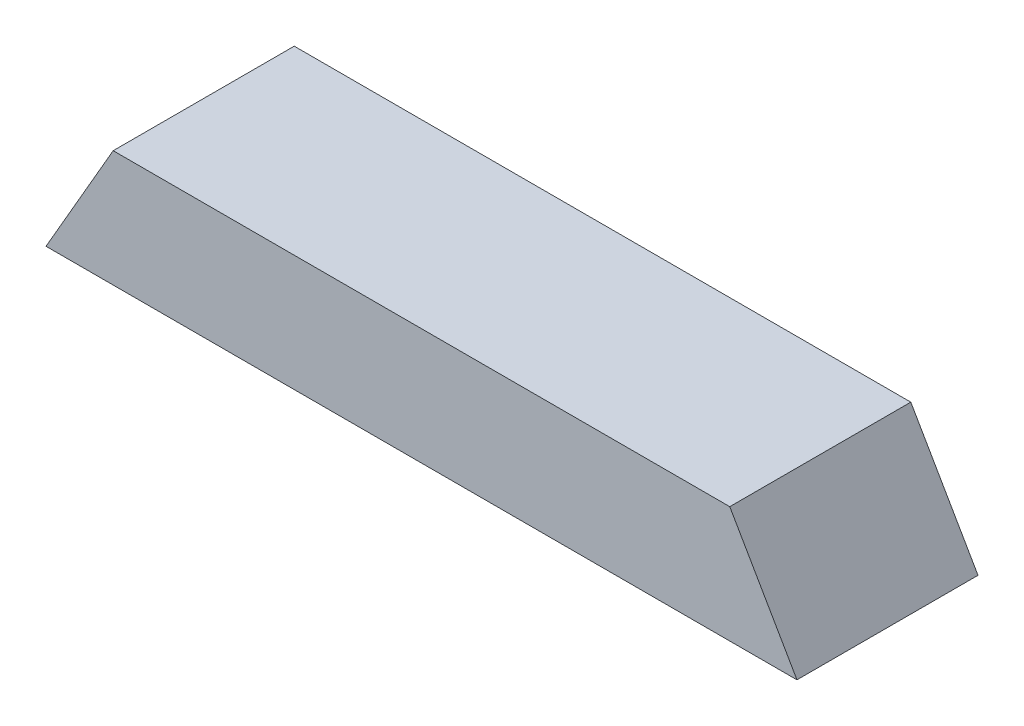
ISO-10303-21;
HEADER;
FILE_DESCRIPTION(('STEP AP214'),'2;1');
FILE_NAME('part.step','',(''),(''),'','','');
FILE_SCHEMA(('AUTOMOTIVE_DESIGN { 1 0 10303 214 1 1 1 1 }'));
ENDSEC;
DATA;
#1=APPLICATION_CONTEXT('core data for automotive mechanical design processes');
#2=APPLICATION_PROTOCOL_DEFINITION('international standard','automotive_design',2000,#1);
#3=PRODUCT_CONTEXT('',#1,'mechanical');
#4=PRODUCT('Part','Part','',(#3));
#5=PRODUCT_RELATED_PRODUCT_CATEGORY('part','',(#4));
#6=PRODUCT_DEFINITION_FORMATION('','',#4);
#7=PRODUCT_DEFINITION_CONTEXT('part definition',#1,'design');
#8=PRODUCT_DEFINITION('design','',#6,#7);
#9=PRODUCT_DEFINITION_SHAPE('','',#8);
#10=(LENGTH_UNIT() NAMED_UNIT(*) SI_UNIT(.MILLI.,.METRE.));
#11=(NAMED_UNIT(*) PLANE_ANGLE_UNIT() SI_UNIT($,.RADIAN.));
#12=(NAMED_UNIT(*) SI_UNIT($,.STERADIAN.) SOLID_ANGLE_UNIT());
#13=UNCERTAINTY_MEASURE_WITH_UNIT(LENGTH_MEASURE(1.E-05),#10,'distance_accuracy_value','');
#14=(GEOMETRIC_REPRESENTATION_CONTEXT(3) GLOBAL_UNCERTAINTY_ASSIGNED_CONTEXT((#13)) GLOBAL_UNIT_ASSIGNED_CONTEXT((#10,
#11,#12)) REPRESENTATION_CONTEXT('',''));
#15=CARTESIAN_POINT('',(0.,0.,0.));
#16=DIRECTION('',(0.,0.,1.));
#17=DIRECTION('',(1.,0.,0.));
#18=AXIS2_PLACEMENT_3D('',#15,#16,#17);
#19=CARTESIAN_POINT('',(0.,3.6,0.));
#20=DIRECTION('',(0.,0.,-1.));
#21=DIRECTION('',(-1.,0.,0.));
#22=AXIS2_PLACEMENT_3D('',#19,#20,#21);
#23=PLANE('',#22);
#24=DIRECTION('',(1.,0.,0.));
#25=VECTOR('',#24,1.);
#26=CARTESIAN_POINT('',(0.,0.,0.));
#27=LINE('',#26,#25);
#28=CARTESIAN_POINT('',(1.38564064605514,0.,0.));
#29=VERTEX_POINT('',#28);
#30=CARTESIAN_POINT('',(24.6143593539449,0.,0.));
#31=VERTEX_POINT('',#30);
#32=EDGE_CURVE('E114',#29,#31,#27,.T.);
#33=ORIENTED_EDGE('',*,*,#32,.T.);
#34=DIRECTION('',(0.500000000000006,-0.866025403784436,0.));
#35=VECTOR('',#34,1.);
#36=CARTESIAN_POINT('',(22.5358983848622,3.6,0.));
#37=LINE('',#36,#35);
#38=CARTESIAN_POINT('',(22.5358983848622,3.6,0.));
#39=VERTEX_POINT('',#38);
#40=EDGE_CURVE('E11',#31,#39,#37,.F.);
#41=ORIENTED_EDGE('',*,*,#40,.T.);
#42=DIRECTION('',(1.,0.,0.));
#43=VECTOR('',#42,1.);
#44=CARTESIAN_POINT('',(0.,3.6,0.));
#45=LINE('',#44,#43);
#46=CARTESIAN_POINT('',(3.46410161513782,3.6,0.));
#47=VERTEX_POINT('',#46);
#48=EDGE_CURVE('E99',#47,#39,#45,.T.);
#49=ORIENTED_EDGE('',*,*,#48,.F.);
#50=DIRECTION('',(0.500000000000006,0.866025403784436,0.));
#51=VECTOR('',#50,1.);
#52=CARTESIAN_POINT('',(3.46410161513782,3.6,0.));
#53=LINE('',#52,#51);
#54=EDGE_CURVE('E57',#47,#29,#53,.F.);
#55=ORIENTED_EDGE('',*,*,#54,.T.);
#56=EDGE_LOOP('',(#33,#41,#49,#55));
#57=FACE_BOUND('',#56,.T.);
#58=ADVANCED_FACE('F47',(#57),#23,.F.);
#59=CARTESIAN_POINT('',(0.,3.6,-5.6));
#60=DIRECTION('',(0.,0.,1.));
#61=DIRECTION('',(1.,0.,0.));
#62=AXIS2_PLACEMENT_3D('',#59,#60,#61);
#63=PLANE('',#62);
#64=DIRECTION('',(-1.,0.,0.));
#65=VECTOR('',#64,1.);
#66=CARTESIAN_POINT('',(0.,3.6,-5.6));
#67=LINE('',#66,#65);
#68=CARTESIAN_POINT('',(22.5358983848622,3.6,-5.6));
#69=VERTEX_POINT('',#68);
#70=CARTESIAN_POINT('',(3.46410161513782,3.6,-5.6));
#71=VERTEX_POINT('',#70);
#72=EDGE_CURVE('E102',#69,#71,#67,.T.);
#73=ORIENTED_EDGE('',*,*,#72,.F.);
#74=DIRECTION('',(-0.500000000000006,0.866025403784436,0.));
#75=VECTOR('',#74,1.);
#76=CARTESIAN_POINT('',(22.5358983848622,3.6,-5.6));
#77=LINE('',#76,#75);
#78=CARTESIAN_POINT('',(24.6143593539449,0.,-5.6));
#79=VERTEX_POINT('',#78);
#80=EDGE_CURVE('E124',#69,#79,#77,.F.);
#81=ORIENTED_EDGE('',*,*,#80,.T.);
#82=DIRECTION('',(-1.,0.,0.));
#83=VECTOR('',#82,1.);
#84=CARTESIAN_POINT('',(0.,0.,-5.6));
#85=LINE('',#84,#83);
#86=CARTESIAN_POINT('',(1.38564064605514,0.,-5.6));
#87=VERTEX_POINT('',#86);
#88=EDGE_CURVE('E108',#79,#87,#85,.T.);
#89=ORIENTED_EDGE('',*,*,#88,.T.);
#90=DIRECTION('',(-0.500000000000006,-0.866025403784436,0.));
#91=VECTOR('',#90,1.);
#92=CARTESIAN_POINT('',(3.46410161513782,3.6,-5.6));
#93=LINE('',#92,#91);
#94=EDGE_CURVE('E121',#87,#71,#93,.F.);
#95=ORIENTED_EDGE('',*,*,#94,.T.);
#96=EDGE_LOOP('',(#73,#81,#89,#95));
#97=FACE_BOUND('',#96,.T.);
#98=ADVANCED_FACE('F132',(#97),#63,.F.);
#99=CARTESIAN_POINT('',(0.,3.6,0.));
#100=DIRECTION('',(0.,-1.,0.));
#101=DIRECTION('',(0.,0.,-1.));
#102=AXIS2_PLACEMENT_3D('',#99,#100,#101);
#103=PLANE('',#102);
#104=ORIENTED_EDGE('',*,*,#48,.T.);
#105=DIRECTION('',(0.,0.,-1.));
#106=VECTOR('',#105,1.);
#107=CARTESIAN_POINT('',(22.5358983848622,3.6,0.));
#108=LINE('',#107,#106);
#109=EDGE_CURVE('E104',#39,#69,#108,.T.);
#110=ORIENTED_EDGE('',*,*,#109,.T.);
#111=ORIENTED_EDGE('',*,*,#72,.T.);
#112=DIRECTION('',(0.,0.,1.));
#113=VECTOR('',#112,1.);
#114=CARTESIAN_POINT('',(3.46410161513782,3.6,0.));
#115=LINE('',#114,#113);
#116=EDGE_CURVE('E91',#71,#47,#115,.T.);
#117=ORIENTED_EDGE('',*,*,#116,.T.);
#118=EDGE_LOOP('',(#104,#110,#111,#117));
#119=FACE_BOUND('',#118,.T.);
#120=ADVANCED_FACE('F97',(#119),#103,.F.);
#121=CARTESIAN_POINT('',(0.,0.,0.));
#122=DIRECTION('',(0.,-1.,0.));
#123=DIRECTION('',(0.,0.,-1.));
#124=AXIS2_PLACEMENT_3D('',#121,#122,#123);
#125=PLANE('',#124);
#126=ORIENTED_EDGE('',*,*,#88,.F.);
#127=DIRECTION('',(0.,0.,-1.));
#128=VECTOR('',#127,1.);
#129=CARTESIAN_POINT('',(24.6143593539449,0.,0.));
#130=LINE('',#129,#128);
#131=EDGE_CURVE('E64',#79,#31,#130,.F.);
#132=ORIENTED_EDGE('',*,*,#131,.T.);
#133=ORIENTED_EDGE('',*,*,#32,.F.);
#134=DIRECTION('',(0.,0.,1.));
#135=VECTOR('',#134,1.);
#136=CARTESIAN_POINT('',(1.38564064605514,0.,0.));
#137=LINE('',#136,#135);
#138=EDGE_CURVE('E92',#29,#87,#137,.F.);
#139=ORIENTED_EDGE('',*,*,#138,.T.);
#140=EDGE_LOOP('',(#126,#132,#133,#139));
#141=FACE_BOUND('',#140,.T.);
#142=ADVANCED_FACE('F130',(#141),#125,.T.);
#143=CARTESIAN_POINT('',(22.5358983848622,3.6,0.));
#144=DIRECTION('',(-0.866025403784435,-0.500000000000006,0.));
#145=DIRECTION('',(0.,0.,-1.));
#146=AXIS2_PLACEMENT_3D('',#143,#144,#145);
#147=PLANE('',#146);
#148=ORIENTED_EDGE('',*,*,#40,.F.);
#149=ORIENTED_EDGE('',*,*,#131,.F.);
#150=ORIENTED_EDGE('',*,*,#80,.F.);
#151=ORIENTED_EDGE('',*,*,#109,.F.);
#152=EDGE_LOOP('',(#148,#149,#150,#151));
#153=FACE_BOUND('',#152,.T.);
#154=ADVANCED_FACE('F134',(#153),#147,.F.);
#155=CARTESIAN_POINT('',(3.46410161513782,3.6,0.));
#156=DIRECTION('',(0.866025403784435,-0.500000000000006,0.));
#157=DIRECTION('',(0.,0.,1.));
#158=AXIS2_PLACEMENT_3D('',#155,#156,#157);
#159=PLANE('',#158);
#160=ORIENTED_EDGE('',*,*,#94,.F.);
#161=ORIENTED_EDGE('',*,*,#138,.F.);
#162=ORIENTED_EDGE('',*,*,#54,.F.);
#163=ORIENTED_EDGE('',*,*,#116,.F.);
#164=EDGE_LOOP('',(#160,#161,#162,#163));
#165=FACE_BOUND('',#164,.T.);
#166=ADVANCED_FACE('F50',(#165),#159,.F.);
#167=CLOSED_SHELL('',(#58,#98,#120,#142,#154,#166));
#168=MANIFOLD_SOLID_BREP('B2',#167);
#169=ADVANCED_BREP_SHAPE_REPRESENTATION('',(#18,#168),#14);
#170=SHAPE_DEFINITION_REPRESENTATION(#9,#169);
ENDSEC;
END-ISO-10303-21;
